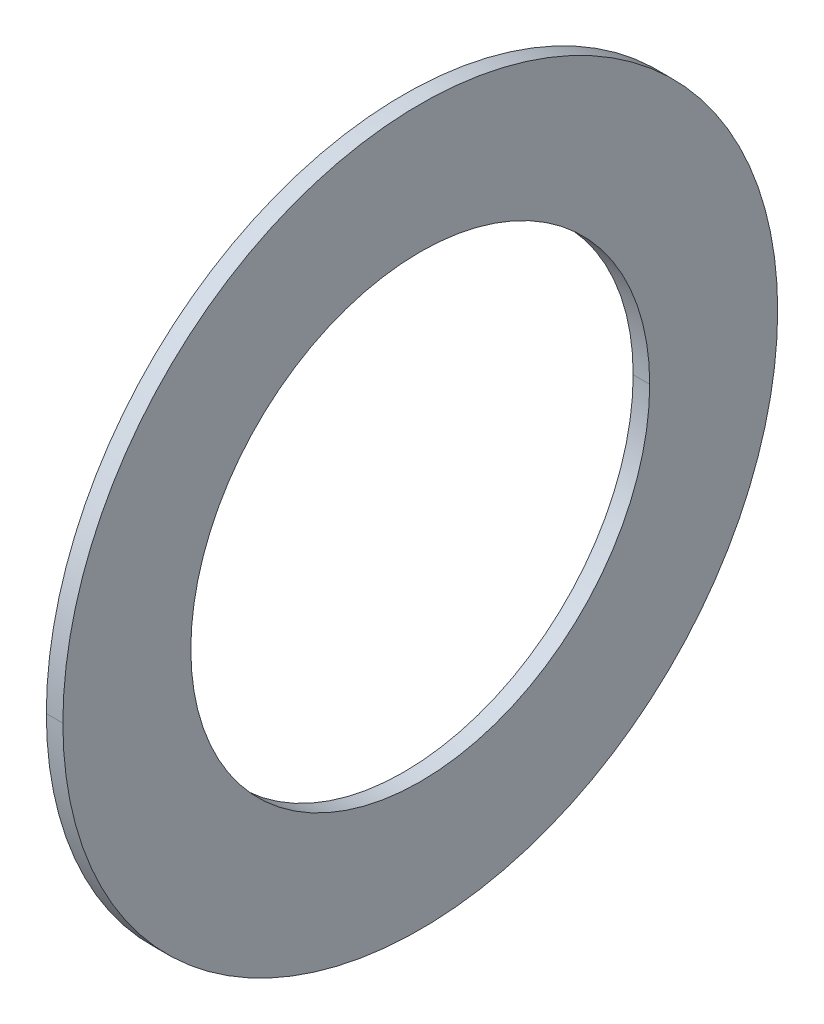
ISO-10303-21;
HEADER;
FILE_DESCRIPTION(('STEP AP214'),'2;1');
FILE_NAME('part.step','',(''),(''),'','','');
FILE_SCHEMA(('AUTOMOTIVE_DESIGN { 1 0 10303 214 1 1 1 1 }'));
ENDSEC;
DATA;
#1=APPLICATION_CONTEXT('core data for automotive mechanical design processes');
#2=APPLICATION_PROTOCOL_DEFINITION('international standard','automotive_design',2000,#1);
#3=PRODUCT_CONTEXT('',#1,'mechanical');
#4=PRODUCT('Part','Part','',(#3));
#5=PRODUCT_RELATED_PRODUCT_CATEGORY('part','',(#4));
#6=PRODUCT_DEFINITION_FORMATION('','',#4);
#7=PRODUCT_DEFINITION_CONTEXT('part definition',#1,'design');
#8=PRODUCT_DEFINITION('design','',#6,#7);
#9=PRODUCT_DEFINITION_SHAPE('','',#8);
#10=(LENGTH_UNIT() NAMED_UNIT(*) SI_UNIT(.MILLI.,.METRE.));
#11=(NAMED_UNIT(*) PLANE_ANGLE_UNIT() SI_UNIT($,.RADIAN.));
#12=(NAMED_UNIT(*) SI_UNIT($,.STERADIAN.) SOLID_ANGLE_UNIT());
#13=UNCERTAINTY_MEASURE_WITH_UNIT(LENGTH_MEASURE(1.E-05),#10,'distance_accuracy_value','');
#14=(GEOMETRIC_REPRESENTATION_CONTEXT(3) GLOBAL_UNCERTAINTY_ASSIGNED_CONTEXT((#13)) GLOBAL_UNIT_ASSIGNED_CONTEXT((#10,
#11,#12)) REPRESENTATION_CONTEXT('',''));
#15=CARTESIAN_POINT('',(0.,0.,0.));
#16=DIRECTION('',(0.,0.,1.));
#17=DIRECTION('',(1.,0.,0.));
#18=AXIS2_PLACEMENT_3D('',#15,#16,#17);
#19=CARTESIAN_POINT('',(3.75,4.05,0.));
#20=DIRECTION('',(-1.,0.,0.));
#21=DIRECTION('',(0.,0.,1.));
#22=AXIS2_PLACEMENT_3D('',#19,#20,#21);
#23=PLANE('',#22);
#24=CARTESIAN_POINT('',(3.75,0.,0.));
#25=DIRECTION('',(1.,0.,0.));
#26=DIRECTION('',(0.,0.,-1.));
#27=AXIS2_PLACEMENT_3D('',#24,#25,#26);
#28=CIRCLE('',#27,2.6);
#29=CARTESIAN_POINT('',(3.75,0.,-2.6));
#30=VERTEX_POINT('',#29);
#31=CARTESIAN_POINT('',(3.75,0.,2.6));
#32=VERTEX_POINT('',#31);
#33=EDGE_CURVE('E11',#30,#32,#28,.T.);
#34=ORIENTED_EDGE('',*,*,#33,.T.);
#35=CARTESIAN_POINT('',(3.75,0.,0.));
#36=DIRECTION('',(1.,0.,0.));
#37=DIRECTION('',(0.,0.,-1.));
#38=AXIS2_PLACEMENT_3D('',#35,#36,#37);
#39=CIRCLE('',#38,2.6);
#40=EDGE_CURVE('E25',#32,#30,#39,.T.);
#41=ORIENTED_EDGE('',*,*,#40,.T.);
#42=EDGE_LOOP('',(#34,#41));
#43=FACE_BOUND('',#42,.T.);
#44=CARTESIAN_POINT('',(3.75,0.,0.));
#45=DIRECTION('',(1.,0.,0.));
#46=DIRECTION('',(0.,0.,-1.));
#47=AXIS2_PLACEMENT_3D('',#44,#45,#46);
#48=CIRCLE('',#47,4.05);
#49=CARTESIAN_POINT('',(3.75,0.,-4.05));
#50=VERTEX_POINT('',#49);
#51=CARTESIAN_POINT('',(3.75,0.,4.05));
#52=VERTEX_POINT('',#51);
#53=EDGE_CURVE('E96',#50,#52,#48,.T.);
#54=ORIENTED_EDGE('',*,*,#53,.F.);
#55=CARTESIAN_POINT('',(3.75,0.,0.));
#56=DIRECTION('',(1.,0.,0.));
#57=DIRECTION('',(0.,0.,-1.));
#58=AXIS2_PLACEMENT_3D('',#55,#56,#57);
#59=CIRCLE('',#58,4.05);
#60=EDGE_CURVE('E91',#52,#50,#59,.T.);
#61=ORIENTED_EDGE('',*,*,#60,.F.);
#62=EDGE_LOOP('',(#54,#61));
#63=FACE_BOUND('',#62,.T.);
#64=ADVANCED_FACE('F17',(#43,#63),#23,.T.);
#65=CARTESIAN_POINT('',(3.9374,0.,0.));
#66=DIRECTION('',(-1.,0.,0.));
#67=DIRECTION('',(0.,1.,0.));
#68=AXIS2_PLACEMENT_3D('',#65,#66,#67);
#69=CYLINDRICAL_SURFACE('',#68,4.05);
#70=ORIENTED_EDGE('',*,*,#60,.T.);
#71=DIRECTION('',(-1.,0.,0.));
#72=VECTOR('',#71,1.);
#73=CARTESIAN_POINT('',(3.9374,0.,-4.05));
#74=LINE('',#73,#72);
#75=CARTESIAN_POINT('',(3.9374,0.,-4.05));
#76=VERTEX_POINT('',#75);
#77=EDGE_CURVE('E86',#76,#50,#74,.T.);
#78=ORIENTED_EDGE('',*,*,#77,.F.);
#79=CARTESIAN_POINT('',(3.9374,0.,0.));
#80=DIRECTION('',(1.,0.,0.));
#81=DIRECTION('',(0.,0.,-1.));
#82=AXIS2_PLACEMENT_3D('',#79,#80,#81);
#83=CIRCLE('',#82,4.05);
#84=CARTESIAN_POINT('',(3.9374,0.,4.05));
#85=VERTEX_POINT('',#84);
#86=EDGE_CURVE('E81',#85,#76,#83,.T.);
#87=ORIENTED_EDGE('',*,*,#86,.F.);
#88=DIRECTION('',(-1.,0.,0.));
#89=VECTOR('',#88,1.);
#90=CARTESIAN_POINT('',(3.9374,0.,4.05));
#91=LINE('',#90,#89);
#92=EDGE_CURVE('E70',#85,#52,#91,.T.);
#93=ORIENTED_EDGE('',*,*,#92,.T.);
#94=EDGE_LOOP('',(#70,#78,#87,#93));
#95=FACE_BOUND('',#94,.T.);
#96=ADVANCED_FACE('F111',(#95),#69,.T.);
#97=CARTESIAN_POINT('',(3.9374,0.,0.));
#98=DIRECTION('',(-1.,0.,0.));
#99=DIRECTION('',(0.,-1.,0.));
#100=AXIS2_PLACEMENT_3D('',#97,#98,#99);
#101=CYLINDRICAL_SURFACE('',#100,4.05);
#102=CARTESIAN_POINT('',(3.9374,0.,0.));
#103=DIRECTION('',(1.,0.,0.));
#104=DIRECTION('',(0.,0.,-1.));
#105=AXIS2_PLACEMENT_3D('',#102,#103,#104);
#106=CIRCLE('',#105,4.05);
#107=EDGE_CURVE('E67',#76,#85,#106,.T.);
#108=ORIENTED_EDGE('',*,*,#107,.F.);
#109=ORIENTED_EDGE('',*,*,#77,.T.);
#110=ORIENTED_EDGE('',*,*,#53,.T.);
#111=ORIENTED_EDGE('',*,*,#92,.F.);
#112=EDGE_LOOP('',(#108,#109,#110,#111));
#113=FACE_BOUND('',#112,.T.);
#114=ADVANCED_FACE('F108',(#113),#101,.T.);
#115=CARTESIAN_POINT('',(3.9374,2.6,0.));
#116=DIRECTION('',(1.,0.,0.));
#117=DIRECTION('',(0.,0.,-1.));
#118=AXIS2_PLACEMENT_3D('',#115,#116,#117);
#119=PLANE('',#118);
#120=ORIENTED_EDGE('',*,*,#107,.T.);
#121=ORIENTED_EDGE('',*,*,#86,.T.);
#122=EDGE_LOOP('',(#120,#121));
#123=FACE_BOUND('',#122,.T.);
#124=CARTESIAN_POINT('',(3.9374,0.,0.));
#125=DIRECTION('',(1.,0.,0.));
#126=DIRECTION('',(0.,0.,-1.));
#127=AXIS2_PLACEMENT_3D('',#124,#125,#126);
#128=CIRCLE('',#127,2.6);
#129=CARTESIAN_POINT('',(3.9374,0.,-2.6));
#130=VERTEX_POINT('',#129);
#131=CARTESIAN_POINT('',(3.9374,0.,2.6));
#132=VERTEX_POINT('',#131);
#133=EDGE_CURVE('E56',#130,#132,#128,.T.);
#134=ORIENTED_EDGE('',*,*,#133,.F.);
#135=CARTESIAN_POINT('',(3.9374,0.,0.));
#136=DIRECTION('',(1.,0.,0.));
#137=DIRECTION('',(0.,0.,-1.));
#138=AXIS2_PLACEMENT_3D('',#135,#136,#137);
#139=CIRCLE('',#138,2.6);
#140=EDGE_CURVE('E52',#132,#130,#139,.T.);
#141=ORIENTED_EDGE('',*,*,#140,.F.);
#142=EDGE_LOOP('',(#134,#141));
#143=FACE_BOUND('',#142,.T.);
#144=ADVANCED_FACE('F54',(#123,#143),#119,.T.);
#145=CARTESIAN_POINT('',(3.9374,0.,0.));
#146=DIRECTION('',(-1.,0.,0.));
#147=DIRECTION('',(0.,1.,0.));
#148=AXIS2_PLACEMENT_3D('',#145,#146,#147);
#149=CYLINDRICAL_SURFACE('',#148,2.6);
#150=ORIENTED_EDGE('',*,*,#40,.F.);
#151=DIRECTION('',(-1.,0.,0.));
#152=VECTOR('',#151,1.);
#153=CARTESIAN_POINT('',(3.9374,0.,2.6));
#154=LINE('',#153,#152);
#155=EDGE_CURVE('E59',#132,#32,#154,.T.);
#156=ORIENTED_EDGE('',*,*,#155,.F.);
#157=ORIENTED_EDGE('',*,*,#140,.T.);
#158=DIRECTION('',(-1.,0.,0.));
#159=VECTOR('',#158,1.);
#160=CARTESIAN_POINT('',(3.9374,0.,-2.6));
#161=LINE('',#160,#159);
#162=EDGE_CURVE('E64',#130,#30,#161,.T.);
#163=ORIENTED_EDGE('',*,*,#162,.T.);
#164=EDGE_LOOP('',(#150,#156,#157,#163));
#165=FACE_BOUND('',#164,.T.);
#166=ADVANCED_FACE('F62',(#165),#149,.F.);
#167=CARTESIAN_POINT('',(3.9374,0.,0.));
#168=DIRECTION('',(-1.,0.,0.));
#169=DIRECTION('',(0.,-1.,0.));
#170=AXIS2_PLACEMENT_3D('',#167,#168,#169);
#171=CYLINDRICAL_SURFACE('',#170,2.6);
#172=ORIENTED_EDGE('',*,*,#133,.T.);
#173=ORIENTED_EDGE('',*,*,#155,.T.);
#174=ORIENTED_EDGE('',*,*,#33,.F.);
#175=ORIENTED_EDGE('',*,*,#162,.F.);
#176=EDGE_LOOP('',(#172,#173,#174,#175));
#177=FACE_BOUND('',#176,.T.);
#178=ADVANCED_FACE('F66',(#177),#171,.F.);
#179=CLOSED_SHELL('',(#64,#96,#114,#144,#166,#178));
#180=MANIFOLD_SOLID_BREP('B1',#179);
#181=ADVANCED_BREP_SHAPE_REPRESENTATION('',(#18,#180),#14);
#182=SHAPE_DEFINITION_REPRESENTATION(#9,#181);
ENDSEC;
END-ISO-10303-21;
